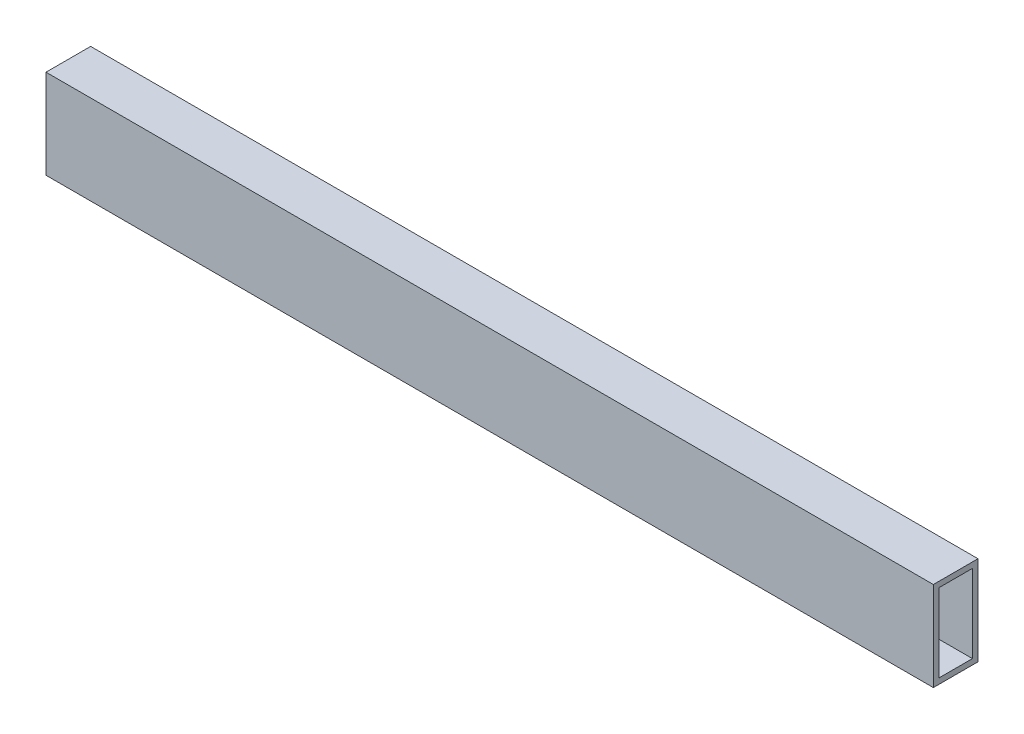
ISO-10303-21;
HEADER;
FILE_DESCRIPTION(('STEP AP214'),'2;1');
FILE_NAME('part.step','',(''),(''),'','','');
FILE_SCHEMA(('AUTOMOTIVE_DESIGN { 1 0 10303 214 1 1 1 1 }'));
ENDSEC;
DATA;
#1=APPLICATION_CONTEXT('core data for automotive mechanical design processes');
#2=APPLICATION_PROTOCOL_DEFINITION('international standard','automotive_design',2000,#1);
#3=PRODUCT_CONTEXT('',#1,'mechanical');
#4=PRODUCT('Part','Part','',(#3));
#5=PRODUCT_RELATED_PRODUCT_CATEGORY('part','',(#4));
#6=PRODUCT_DEFINITION_FORMATION('','',#4);
#7=PRODUCT_DEFINITION_CONTEXT('part definition',#1,'design');
#8=PRODUCT_DEFINITION('design','',#6,#7);
#9=PRODUCT_DEFINITION_SHAPE('','',#8);
#10=(LENGTH_UNIT() NAMED_UNIT(*) SI_UNIT(.MILLI.,.METRE.));
#11=(NAMED_UNIT(*) PLANE_ANGLE_UNIT() SI_UNIT($,.RADIAN.));
#12=(NAMED_UNIT(*) SI_UNIT($,.STERADIAN.) SOLID_ANGLE_UNIT());
#13=UNCERTAINTY_MEASURE_WITH_UNIT(LENGTH_MEASURE(1.E-05),#10,'distance_accuracy_value','');
#14=(GEOMETRIC_REPRESENTATION_CONTEXT(3) GLOBAL_UNCERTAINTY_ASSIGNED_CONTEXT((#13)) GLOBAL_UNIT_ASSIGNED_CONTEXT((#10,
#11,#12)) REPRESENTATION_CONTEXT('',''));
#15=CARTESIAN_POINT('',(0.,0.,0.));
#16=DIRECTION('',(0.,0.,1.));
#17=DIRECTION('',(1.,0.,0.));
#18=AXIS2_PLACEMENT_3D('',#15,#16,#17);
#19=CARTESIAN_POINT('',(504.825,0.,0.));
#20=DIRECTION('',(-1.,0.,0.));
#21=DIRECTION('',(0.,0.,1.));
#22=AXIS2_PLACEMENT_3D('',#19,#20,#21);
#23=PLANE('',#22);
#24=DIRECTION('',(0.,-1.,0.));
#25=VECTOR('',#24,1.);
#26=CARTESIAN_POINT('',(504.825,0.,0.));
#27=LINE('',#26,#25);
#28=CARTESIAN_POINT('',(504.825,50.8,0.));
#29=VERTEX_POINT('',#28);
#30=CARTESIAN_POINT('',(504.825,0.,0.));
#31=VERTEX_POINT('',#30);
#32=EDGE_CURVE('E134',#29,#31,#27,.T.);
#33=ORIENTED_EDGE('',*,*,#32,.T.);
#34=DIRECTION('',(0.,0.,-1.));
#35=VECTOR('',#34,1.);
#36=CARTESIAN_POINT('',(504.825,0.,0.));
#37=LINE('',#36,#35);
#38=CARTESIAN_POINT('',(504.825,0.,-25.4));
#39=VERTEX_POINT('',#38);
#40=EDGE_CURVE('E137',#31,#39,#37,.T.);
#41=ORIENTED_EDGE('',*,*,#40,.T.);
#42=DIRECTION('',(0.,1.,0.));
#43=VECTOR('',#42,1.);
#44=CARTESIAN_POINT('',(504.825,0.,-25.4));
#45=LINE('',#44,#43);
#46=CARTESIAN_POINT('',(504.825,50.8,-25.4));
#47=VERTEX_POINT('',#46);
#48=EDGE_CURVE('E140',#39,#47,#45,.T.);
#49=ORIENTED_EDGE('',*,*,#48,.T.);
#50=DIRECTION('',(0.,0.,1.));
#51=VECTOR('',#50,1.);
#52=CARTESIAN_POINT('',(504.825,50.8,0.));
#53=LINE('',#52,#51);
#54=EDGE_CURVE('E142',#47,#29,#53,.T.);
#55=ORIENTED_EDGE('',*,*,#54,.T.);
#56=EDGE_LOOP('',(#33,#41,#49,#55));
#57=FACE_BOUND('',#56,.T.);
#58=DIRECTION('',(0.,-1.,0.));
#59=VECTOR('',#58,1.);
#60=CARTESIAN_POINT('',(504.825,47.625,-3.175));
#61=LINE('',#60,#59);
#62=CARTESIAN_POINT('',(504.825,47.625,-3.175));
#63=VERTEX_POINT('',#62);
#64=CARTESIAN_POINT('',(504.825,3.175,-3.175));
#65=VERTEX_POINT('',#64);
#66=EDGE_CURVE('E98',#63,#65,#61,.T.);
#67=ORIENTED_EDGE('',*,*,#66,.F.);
#68=DIRECTION('',(0.,0.,1.));
#69=VECTOR('',#68,1.);
#70=CARTESIAN_POINT('',(504.825,47.625,-3.175));
#71=LINE('',#70,#69);
#72=CARTESIAN_POINT('',(504.825,47.625,-22.225));
#73=VERTEX_POINT('',#72);
#74=EDGE_CURVE('E120',#73,#63,#71,.T.);
#75=ORIENTED_EDGE('',*,*,#74,.F.);
#76=DIRECTION('',(0.,1.,0.));
#77=VECTOR('',#76,1.);
#78=CARTESIAN_POINT('',(504.825,47.625,-22.225));
#79=LINE('',#78,#77);
#80=CARTESIAN_POINT('',(504.825,3.175,-22.225));
#81=VERTEX_POINT('',#80);
#82=EDGE_CURVE('E118',#81,#73,#79,.T.);
#83=ORIENTED_EDGE('',*,*,#82,.F.);
#84=DIRECTION('',(0.,0.,-1.));
#85=VECTOR('',#84,1.);
#86=CARTESIAN_POINT('',(504.825,3.175,-3.175));
#87=LINE('',#86,#85);
#88=EDGE_CURVE('E106',#65,#81,#87,.T.);
#89=ORIENTED_EDGE('',*,*,#88,.F.);
#90=EDGE_LOOP('',(#67,#75,#83,#89));
#91=FACE_BOUND('',#90,.T.);
#92=ADVANCED_FACE('F33',(#57,#91),#23,.F.);
#93=CARTESIAN_POINT('',(0.,0.,0.));
#94=DIRECTION('',(-1.,0.,0.));
#95=DIRECTION('',(0.,0.,1.));
#96=AXIS2_PLACEMENT_3D('',#93,#94,#95);
#97=PLANE('',#96);
#98=DIRECTION('',(0.,-1.,0.));
#99=VECTOR('',#98,1.);
#100=CARTESIAN_POINT('',(0.,0.,0.));
#101=LINE('',#100,#99);
#102=CARTESIAN_POINT('',(0.,50.8,0.));
#103=VERTEX_POINT('',#102);
#104=CARTESIAN_POINT('',(0.,0.,0.));
#105=VERTEX_POINT('',#104);
#106=EDGE_CURVE('E114',#103,#105,#101,.T.);
#107=ORIENTED_EDGE('',*,*,#106,.F.);
#108=DIRECTION('',(0.,0.,1.));
#109=VECTOR('',#108,1.);
#110=CARTESIAN_POINT('',(0.,50.8,0.));
#111=LINE('',#110,#109);
#112=CARTESIAN_POINT('',(0.,50.8,-25.4));
#113=VERTEX_POINT('',#112);
#114=EDGE_CURVE('E138',#113,#103,#111,.T.);
#115=ORIENTED_EDGE('',*,*,#114,.F.);
#116=DIRECTION('',(0.,1.,0.));
#117=VECTOR('',#116,1.);
#118=CARTESIAN_POINT('',(0.,0.,-25.4));
#119=LINE('',#118,#117);
#120=CARTESIAN_POINT('',(0.,0.,-25.4));
#121=VERTEX_POINT('',#120);
#122=EDGE_CURVE('E149',#121,#113,#119,.T.);
#123=ORIENTED_EDGE('',*,*,#122,.F.);
#124=DIRECTION('',(0.,0.,-1.));
#125=VECTOR('',#124,1.);
#126=CARTESIAN_POINT('',(0.,0.,0.));
#127=LINE('',#126,#125);
#128=EDGE_CURVE('E147',#105,#121,#127,.T.);
#129=ORIENTED_EDGE('',*,*,#128,.F.);
#130=EDGE_LOOP('',(#107,#115,#123,#129));
#131=FACE_BOUND('',#130,.T.);
#132=DIRECTION('',(0.,0.,1.));
#133=VECTOR('',#132,1.);
#134=CARTESIAN_POINT('',(0.,47.625,-3.175));
#135=LINE('',#134,#133);
#136=CARTESIAN_POINT('',(0.,47.625,-22.225));
#137=VERTEX_POINT('',#136);
#138=CARTESIAN_POINT('',(0.,47.625,-3.175));
#139=VERTEX_POINT('',#138);
#140=EDGE_CURVE('E107',#137,#139,#135,.T.);
#141=ORIENTED_EDGE('',*,*,#140,.T.);
#142=DIRECTION('',(0.,-1.,0.));
#143=VECTOR('',#142,1.);
#144=CARTESIAN_POINT('',(0.,47.625,-3.175));
#145=LINE('',#144,#143);
#146=CARTESIAN_POINT('',(0.,3.175,-3.175));
#147=VERTEX_POINT('',#146);
#148=EDGE_CURVE('E56',#139,#147,#145,.T.);
#149=ORIENTED_EDGE('',*,*,#148,.T.);
#150=DIRECTION('',(0.,0.,-1.));
#151=VECTOR('',#150,1.);
#152=CARTESIAN_POINT('',(0.,3.175,-3.175));
#153=LINE('',#152,#151);
#154=CARTESIAN_POINT('',(0.,3.175,-22.225));
#155=VERTEX_POINT('',#154);
#156=EDGE_CURVE('E113',#147,#155,#153,.T.);
#157=ORIENTED_EDGE('',*,*,#156,.T.);
#158=DIRECTION('',(0.,1.,0.));
#159=VECTOR('',#158,1.);
#160=CARTESIAN_POINT('',(0.,47.625,-22.225));
#161=LINE('',#160,#159);
#162=EDGE_CURVE('E126',#155,#137,#161,.T.);
#163=ORIENTED_EDGE('',*,*,#162,.T.);
#164=EDGE_LOOP('',(#141,#149,#157,#163));
#165=FACE_BOUND('',#164,.T.);
#166=ADVANCED_FACE('F167',(#131,#165),#97,.T.);
#167=CARTESIAN_POINT('',(504.825,0.,0.));
#168=DIRECTION('',(0.,0.,-1.));
#169=DIRECTION('',(-1.,0.,0.));
#170=AXIS2_PLACEMENT_3D('',#167,#168,#169);
#171=PLANE('',#170);
#172=ORIENTED_EDGE('',*,*,#106,.T.);
#173=DIRECTION('',(-1.,0.,0.));
#174=VECTOR('',#173,1.);
#175=CARTESIAN_POINT('',(504.825,0.,0.));
#176=LINE('',#175,#174);
#177=EDGE_CURVE('E11',#31,#105,#176,.T.);
#178=ORIENTED_EDGE('',*,*,#177,.F.);
#179=ORIENTED_EDGE('',*,*,#32,.F.);
#180=DIRECTION('',(-1.,0.,0.));
#181=VECTOR('',#180,1.);
#182=CARTESIAN_POINT('',(504.825,50.8,0.));
#183=LINE('',#182,#181);
#184=EDGE_CURVE('E144',#29,#103,#183,.T.);
#185=ORIENTED_EDGE('',*,*,#184,.T.);
#186=EDGE_LOOP('',(#172,#178,#179,#185));
#187=FACE_BOUND('',#186,.T.);
#188=ADVANCED_FACE('F35',(#187),#171,.F.);
#189=CARTESIAN_POINT('',(504.825,0.,0.));
#190=DIRECTION('',(0.,1.,0.));
#191=DIRECTION('',(0.,0.,1.));
#192=AXIS2_PLACEMENT_3D('',#189,#190,#191);
#193=PLANE('',#192);
#194=ORIENTED_EDGE('',*,*,#128,.T.);
#195=DIRECTION('',(-1.,0.,0.));
#196=VECTOR('',#195,1.);
#197=CARTESIAN_POINT('',(504.825,0.,-25.4));
#198=LINE('',#197,#196);
#199=EDGE_CURVE('E41',#39,#121,#198,.T.);
#200=ORIENTED_EDGE('',*,*,#199,.F.);
#201=ORIENTED_EDGE('',*,*,#40,.F.);
#202=ORIENTED_EDGE('',*,*,#177,.T.);
#203=EDGE_LOOP('',(#194,#200,#201,#202));
#204=FACE_BOUND('',#203,.T.);
#205=ADVANCED_FACE('F177',(#204),#193,.F.);
#206=CARTESIAN_POINT('',(504.825,0.,-25.4));
#207=DIRECTION('',(0.,0.,1.));
#208=DIRECTION('',(1.,0.,0.));
#209=AXIS2_PLACEMENT_3D('',#206,#207,#208);
#210=PLANE('',#209);
#211=ORIENTED_EDGE('',*,*,#122,.T.);
#212=DIRECTION('',(-1.,0.,0.));
#213=VECTOR('',#212,1.);
#214=CARTESIAN_POINT('',(504.825,50.8,-25.4));
#215=LINE('',#214,#213);
#216=EDGE_CURVE('E154',#47,#113,#215,.T.);
#217=ORIENTED_EDGE('',*,*,#216,.F.);
#218=ORIENTED_EDGE('',*,*,#48,.F.);
#219=ORIENTED_EDGE('',*,*,#199,.T.);
#220=EDGE_LOOP('',(#211,#217,#218,#219));
#221=FACE_BOUND('',#220,.T.);
#222=ADVANCED_FACE('F161',(#221),#210,.F.);
#223=CARTESIAN_POINT('',(504.825,50.8,0.));
#224=DIRECTION('',(0.,-1.,0.));
#225=DIRECTION('',(0.,0.,-1.));
#226=AXIS2_PLACEMENT_3D('',#223,#224,#225);
#227=PLANE('',#226);
#228=ORIENTED_EDGE('',*,*,#114,.T.);
#229=ORIENTED_EDGE('',*,*,#184,.F.);
#230=ORIENTED_EDGE('',*,*,#54,.F.);
#231=ORIENTED_EDGE('',*,*,#216,.T.);
#232=EDGE_LOOP('',(#228,#229,#230,#231));
#233=FACE_BOUND('',#232,.T.);
#234=ADVANCED_FACE('F171',(#233),#227,.F.);
#235=CARTESIAN_POINT('',(504.825,47.625,-3.175));
#236=DIRECTION('',(0.,0.,-1.));
#237=DIRECTION('',(0.,1.,0.));
#238=AXIS2_PLACEMENT_3D('',#235,#236,#237);
#239=PLANE('',#238);
#240=ORIENTED_EDGE('',*,*,#148,.F.);
#241=DIRECTION('',(-1.,0.,0.));
#242=VECTOR('',#241,1.);
#243=CARTESIAN_POINT('',(504.825,47.625,-3.175));
#244=LINE('',#243,#242);
#245=EDGE_CURVE('E102',#63,#139,#244,.T.);
#246=ORIENTED_EDGE('',*,*,#245,.F.);
#247=ORIENTED_EDGE('',*,*,#66,.T.);
#248=DIRECTION('',(-1.,0.,0.));
#249=VECTOR('',#248,1.);
#250=CARTESIAN_POINT('',(504.825,3.175,-3.175));
#251=LINE('',#250,#249);
#252=EDGE_CURVE('E101',#65,#147,#251,.T.);
#253=ORIENTED_EDGE('',*,*,#252,.T.);
#254=EDGE_LOOP('',(#240,#246,#247,#253));
#255=FACE_BOUND('',#254,.T.);
#256=ADVANCED_FACE('F100',(#255),#239,.T.);
#257=CARTESIAN_POINT('',(504.825,3.175,-3.175));
#258=DIRECTION('',(0.,1.,0.));
#259=DIRECTION('',(0.,0.,1.));
#260=AXIS2_PLACEMENT_3D('',#257,#258,#259);
#261=PLANE('',#260);
#262=ORIENTED_EDGE('',*,*,#156,.F.);
#263=ORIENTED_EDGE('',*,*,#252,.F.);
#264=ORIENTED_EDGE('',*,*,#88,.T.);
#265=DIRECTION('',(-1.,0.,0.));
#266=VECTOR('',#265,1.);
#267=CARTESIAN_POINT('',(504.825,3.175,-22.225));
#268=LINE('',#267,#266);
#269=EDGE_CURVE('E115',#81,#155,#268,.T.);
#270=ORIENTED_EDGE('',*,*,#269,.T.);
#271=EDGE_LOOP('',(#262,#263,#264,#270));
#272=FACE_BOUND('',#271,.T.);
#273=ADVANCED_FACE('F110',(#272),#261,.T.);
#274=CARTESIAN_POINT('',(504.825,47.625,-22.225));
#275=DIRECTION('',(0.,0.,1.));
#276=DIRECTION('',(1.,0.,0.));
#277=AXIS2_PLACEMENT_3D('',#274,#275,#276);
#278=PLANE('',#277);
#279=ORIENTED_EDGE('',*,*,#162,.F.);
#280=ORIENTED_EDGE('',*,*,#269,.F.);
#281=ORIENTED_EDGE('',*,*,#82,.T.);
#282=DIRECTION('',(-1.,0.,0.));
#283=VECTOR('',#282,1.);
#284=CARTESIAN_POINT('',(504.825,47.625,-22.225));
#285=LINE('',#284,#283);
#286=EDGE_CURVE('E48',#73,#137,#285,.T.);
#287=ORIENTED_EDGE('',*,*,#286,.T.);
#288=EDGE_LOOP('',(#279,#280,#281,#287));
#289=FACE_BOUND('',#288,.T.);
#290=ADVANCED_FACE('F200',(#289),#278,.T.);
#291=CARTESIAN_POINT('',(504.825,47.625,-3.175));
#292=DIRECTION('',(0.,-1.,0.));
#293=DIRECTION('',(0.,0.,-1.));
#294=AXIS2_PLACEMENT_3D('',#291,#292,#293);
#295=PLANE('',#294);
#296=ORIENTED_EDGE('',*,*,#140,.F.);
#297=ORIENTED_EDGE('',*,*,#286,.F.);
#298=ORIENTED_EDGE('',*,*,#74,.T.);
#299=ORIENTED_EDGE('',*,*,#245,.T.);
#300=EDGE_LOOP('',(#296,#297,#298,#299));
#301=FACE_BOUND('',#300,.T.);
#302=ADVANCED_FACE('F204',(#301),#295,.T.);
#303=CLOSED_SHELL('',(#92,#166,#188,#205,#222,#234,#256,#273,#290,#302));
#304=MANIFOLD_SOLID_BREP('B2',#303);
#305=ADVANCED_BREP_SHAPE_REPRESENTATION('',(#18,#304),#14);
#306=SHAPE_DEFINITION_REPRESENTATION(#9,#305);
ENDSEC;
END-ISO-10303-21;
